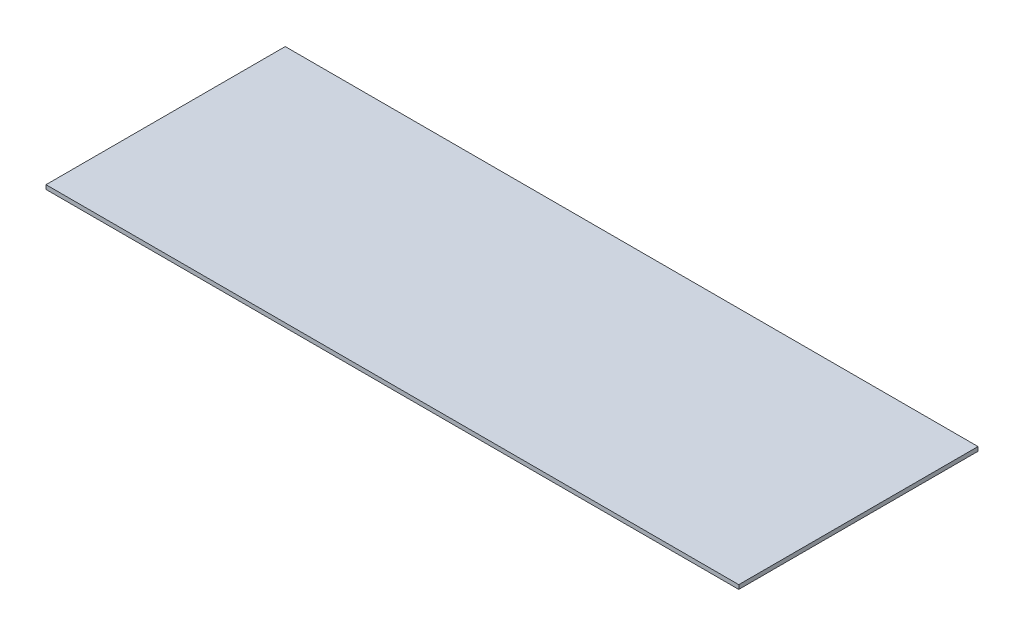
ISO-10303-21;
HEADER;
FILE_DESCRIPTION(('STEP AP214'),'2;1');
FILE_NAME('part.step','',(''),(''),'','','');
FILE_SCHEMA(('AUTOMOTIVE_DESIGN { 1 0 10303 214 1 1 1 1 }'));
ENDSEC;
DATA;
#1=APPLICATION_CONTEXT('core data for automotive mechanical design processes');
#2=APPLICATION_PROTOCOL_DEFINITION('international standard','automotive_design',2000,#1);
#3=PRODUCT_CONTEXT('',#1,'mechanical');
#4=PRODUCT('Part','Part','',(#3));
#5=PRODUCT_RELATED_PRODUCT_CATEGORY('part','',(#4));
#6=PRODUCT_DEFINITION_FORMATION('','',#4);
#7=PRODUCT_DEFINITION_CONTEXT('part definition',#1,'design');
#8=PRODUCT_DEFINITION('design','',#6,#7);
#9=PRODUCT_DEFINITION_SHAPE('','',#8);
#10=(LENGTH_UNIT() NAMED_UNIT(*) SI_UNIT(.MILLI.,.METRE.));
#11=(NAMED_UNIT(*) PLANE_ANGLE_UNIT() SI_UNIT($,.RADIAN.));
#12=(NAMED_UNIT(*) SI_UNIT($,.STERADIAN.) SOLID_ANGLE_UNIT());
#13=UNCERTAINTY_MEASURE_WITH_UNIT(LENGTH_MEASURE(1.E-05),#10,'distance_accuracy_value','');
#14=(GEOMETRIC_REPRESENTATION_CONTEXT(3) GLOBAL_UNCERTAINTY_ASSIGNED_CONTEXT((#13)) GLOBAL_UNIT_ASSIGNED_CONTEXT((#10,
#11,#12)) REPRESENTATION_CONTEXT('',''));
#15=CARTESIAN_POINT('',(0.,0.,0.));
#16=DIRECTION('',(0.,0.,1.));
#17=DIRECTION('',(1.,0.,0.));
#18=AXIS2_PLACEMENT_3D('',#15,#16,#17);
#19=CARTESIAN_POINT('',(0.,1.8,0.));
#20=DIRECTION('',(1.,0.,0.));
#21=DIRECTION('',(0.,0.,-1.));
#22=AXIS2_PLACEMENT_3D('',#19,#20,#21);
#23=PLANE('',#22);
#24=DIRECTION('',(0.,0.,1.));
#25=VECTOR('',#24,1.);
#26=CARTESIAN_POINT('',(0.,0.,0.));
#27=LINE('',#26,#25);
#28=CARTESIAN_POINT('',(0.,0.,-103.6));
#29=VERTEX_POINT('',#28);
#30=CARTESIAN_POINT('',(0.,0.,0.));
#31=VERTEX_POINT('',#30);
#32=EDGE_CURVE('E98',#29,#31,#27,.T.);
#33=ORIENTED_EDGE('',*,*,#32,.T.);
#34=DIRECTION('',(0.,-1.,0.));
#35=VECTOR('',#34,1.);
#36=CARTESIAN_POINT('',(0.,1.8,0.));
#37=LINE('',#36,#35);
#38=CARTESIAN_POINT('',(0.,1.8,0.));
#39=VERTEX_POINT('',#38);
#40=EDGE_CURVE('E11',#39,#31,#37,.T.);
#41=ORIENTED_EDGE('',*,*,#40,.F.);
#42=DIRECTION('',(0.,0.,1.));
#43=VECTOR('',#42,1.);
#44=CARTESIAN_POINT('',(0.,1.8,0.));
#45=LINE('',#44,#43);
#46=CARTESIAN_POINT('',(0.,1.8,-103.6));
#47=VERTEX_POINT('',#46);
#48=EDGE_CURVE('E86',#47,#39,#45,.T.);
#49=ORIENTED_EDGE('',*,*,#48,.F.);
#50=DIRECTION('',(0.,-1.,0.));
#51=VECTOR('',#50,1.);
#52=CARTESIAN_POINT('',(0.,1.8,-103.6));
#53=LINE('',#52,#51);
#54=EDGE_CURVE('E94',#47,#29,#53,.T.);
#55=ORIENTED_EDGE('',*,*,#54,.T.);
#56=EDGE_LOOP('',(#33,#41,#49,#55));
#57=FACE_BOUND('',#56,.T.);
#58=ADVANCED_FACE('F35',(#57),#23,.F.);
#59=CARTESIAN_POINT('',(0.,1.8,0.));
#60=DIRECTION('',(0.,0.,-1.));
#61=DIRECTION('',(-1.,0.,0.));
#62=AXIS2_PLACEMENT_3D('',#59,#60,#61);
#63=PLANE('',#62);
#64=DIRECTION('',(1.,0.,0.));
#65=VECTOR('',#64,1.);
#66=CARTESIAN_POINT('',(0.,0.,0.));
#67=LINE('',#66,#65);
#68=CARTESIAN_POINT('',(300.,0.,0.));
#69=VERTEX_POINT('',#68);
#70=EDGE_CURVE('E90',#31,#69,#67,.T.);
#71=ORIENTED_EDGE('',*,*,#70,.T.);
#72=DIRECTION('',(0.,-1.,0.));
#73=VECTOR('',#72,1.);
#74=CARTESIAN_POINT('',(300.,1.8,0.));
#75=LINE('',#74,#73);
#76=CARTESIAN_POINT('',(300.,1.8,0.));
#77=VERTEX_POINT('',#76);
#78=EDGE_CURVE('E43',#77,#69,#75,.T.);
#79=ORIENTED_EDGE('',*,*,#78,.F.);
#80=DIRECTION('',(1.,0.,0.));
#81=VECTOR('',#80,1.);
#82=CARTESIAN_POINT('',(0.,1.8,0.));
#83=LINE('',#82,#81);
#84=EDGE_CURVE('E81',#39,#77,#83,.T.);
#85=ORIENTED_EDGE('',*,*,#84,.F.);
#86=ORIENTED_EDGE('',*,*,#40,.T.);
#87=EDGE_LOOP('',(#71,#79,#85,#86));
#88=FACE_BOUND('',#87,.T.);
#89=ADVANCED_FACE('F89',(#88),#63,.F.);
#90=CARTESIAN_POINT('',(300.,1.8,0.));
#91=DIRECTION('',(-1.,0.,0.));
#92=DIRECTION('',(0.,0.,1.));
#93=AXIS2_PLACEMENT_3D('',#90,#91,#92);
#94=PLANE('',#93);
#95=DIRECTION('',(0.,0.,-1.));
#96=VECTOR('',#95,1.);
#97=CARTESIAN_POINT('',(300.,0.,0.));
#98=LINE('',#97,#96);
#99=CARTESIAN_POINT('',(300.,0.,-103.6));
#100=VERTEX_POINT('',#99);
#101=EDGE_CURVE('E68',#69,#100,#98,.T.);
#102=ORIENTED_EDGE('',*,*,#101,.T.);
#103=DIRECTION('',(0.,-1.,0.));
#104=VECTOR('',#103,1.);
#105=CARTESIAN_POINT('',(300.,1.8,-103.6));
#106=LINE('',#105,#104);
#107=CARTESIAN_POINT('',(300.,1.8,-103.6));
#108=VERTEX_POINT('',#107);
#109=EDGE_CURVE('E91',#108,#100,#106,.T.);
#110=ORIENTED_EDGE('',*,*,#109,.F.);
#111=DIRECTION('',(0.,0.,-1.));
#112=VECTOR('',#111,1.);
#113=CARTESIAN_POINT('',(300.,1.8,0.));
#114=LINE('',#113,#112);
#115=EDGE_CURVE('E84',#77,#108,#114,.T.);
#116=ORIENTED_EDGE('',*,*,#115,.F.);
#117=ORIENTED_EDGE('',*,*,#78,.T.);
#118=EDGE_LOOP('',(#102,#110,#116,#117));
#119=FACE_BOUND('',#118,.T.);
#120=ADVANCED_FACE('F92',(#119),#94,.F.);
#121=CARTESIAN_POINT('',(0.,1.8,-103.6));
#122=DIRECTION('',(0.,0.,1.));
#123=DIRECTION('',(1.,0.,0.));
#124=AXIS2_PLACEMENT_3D('',#121,#122,#123);
#125=PLANE('',#124);
#126=DIRECTION('',(-1.,0.,0.));
#127=VECTOR('',#126,1.);
#128=CARTESIAN_POINT('',(0.,0.,-103.6));
#129=LINE('',#128,#127);
#130=EDGE_CURVE('E74',#100,#29,#129,.T.);
#131=ORIENTED_EDGE('',*,*,#130,.T.);
#132=ORIENTED_EDGE('',*,*,#54,.F.);
#133=DIRECTION('',(-1.,0.,0.));
#134=VECTOR('',#133,1.);
#135=CARTESIAN_POINT('',(0.,1.8,-103.6));
#136=LINE('',#135,#134);
#137=EDGE_CURVE('E51',#108,#47,#136,.T.);
#138=ORIENTED_EDGE('',*,*,#137,.F.);
#139=ORIENTED_EDGE('',*,*,#109,.T.);
#140=EDGE_LOOP('',(#131,#132,#138,#139));
#141=FACE_BOUND('',#140,.T.);
#142=ADVANCED_FACE('F105',(#141),#125,.F.);
#143=CARTESIAN_POINT('',(0.,1.8,0.));
#144=DIRECTION('',(0.,-1.,0.));
#145=DIRECTION('',(0.,0.,-1.));
#146=AXIS2_PLACEMENT_3D('',#143,#144,#145);
#147=PLANE('',#146);
#148=ORIENTED_EDGE('',*,*,#48,.T.);
#149=ORIENTED_EDGE('',*,*,#84,.T.);
#150=ORIENTED_EDGE('',*,*,#115,.T.);
#151=ORIENTED_EDGE('',*,*,#137,.T.);
#152=EDGE_LOOP('',(#148,#149,#150,#151));
#153=FACE_BOUND('',#152,.T.);
#154=ADVANCED_FACE('F82',(#153),#147,.F.);
#155=CARTESIAN_POINT('',(0.,0.,0.));
#156=DIRECTION('',(0.,-1.,0.));
#157=DIRECTION('',(0.,0.,-1.));
#158=AXIS2_PLACEMENT_3D('',#155,#156,#157);
#159=PLANE('',#158);
#160=ORIENTED_EDGE('',*,*,#32,.F.);
#161=ORIENTED_EDGE('',*,*,#130,.F.);
#162=ORIENTED_EDGE('',*,*,#101,.F.);
#163=ORIENTED_EDGE('',*,*,#70,.F.);
#164=EDGE_LOOP('',(#160,#161,#162,#163));
#165=FACE_BOUND('',#164,.T.);
#166=ADVANCED_FACE('F108',(#165),#159,.T.);
#167=CLOSED_SHELL('',(#58,#89,#120,#142,#154,#166));
#168=MANIFOLD_SOLID_BREP('B2',#167);
#169=ADVANCED_BREP_SHAPE_REPRESENTATION('',(#18,#168),#14);
#170=SHAPE_DEFINITION_REPRESENTATION(#9,#169);
ENDSEC;
END-ISO-10303-21;
